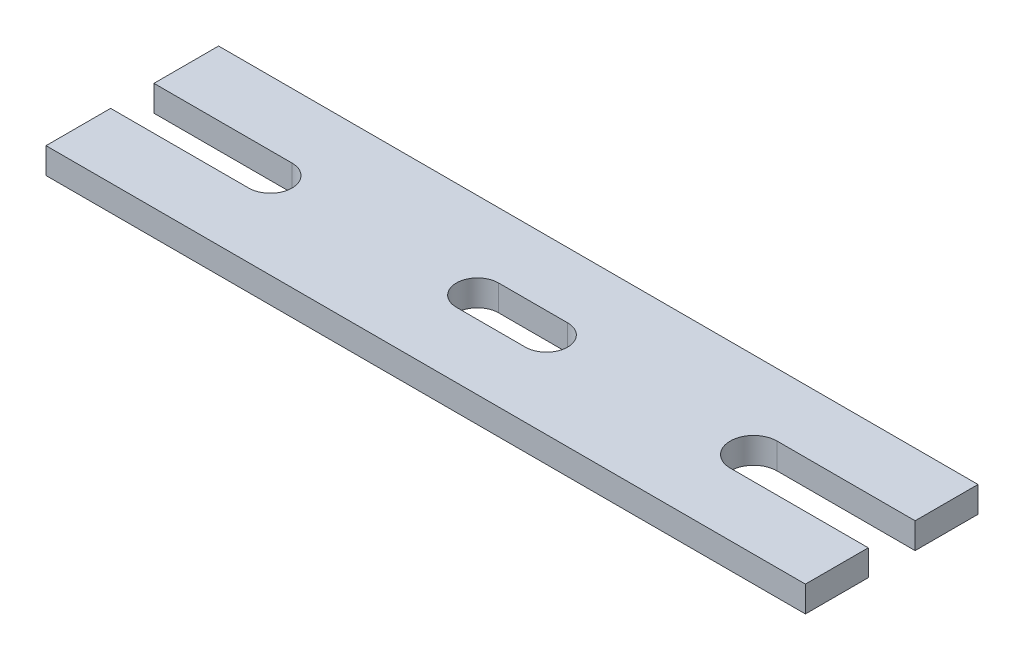
ISO-10303-21;
HEADER;
FILE_DESCRIPTION(('STEP AP214'),'2;1');
FILE_NAME('part.step','',(''),(''),'','','');
FILE_SCHEMA(('AUTOMOTIVE_DESIGN { 1 0 10303 214 1 1 1 1 }'));
ENDSEC;
DATA;
#1=APPLICATION_CONTEXT('core data for automotive mechanical design processes');
#2=APPLICATION_PROTOCOL_DEFINITION('international standard','automotive_design',2000,#1);
#3=PRODUCT_CONTEXT('',#1,'mechanical');
#4=PRODUCT('Part','Part','',(#3));
#5=PRODUCT_RELATED_PRODUCT_CATEGORY('part','',(#4));
#6=PRODUCT_DEFINITION_FORMATION('','',#4);
#7=PRODUCT_DEFINITION_CONTEXT('part definition',#1,'design');
#8=PRODUCT_DEFINITION('design','',#6,#7);
#9=PRODUCT_DEFINITION_SHAPE('','',#8);
#10=(LENGTH_UNIT() NAMED_UNIT(*) SI_UNIT(.MILLI.,.METRE.));
#11=(NAMED_UNIT(*) PLANE_ANGLE_UNIT() SI_UNIT($,.RADIAN.));
#12=(NAMED_UNIT(*) SI_UNIT($,.STERADIAN.) SOLID_ANGLE_UNIT());
#13=UNCERTAINTY_MEASURE_WITH_UNIT(LENGTH_MEASURE(1.E-05),#10,'distance_accuracy_value','');
#14=(GEOMETRIC_REPRESENTATION_CONTEXT(3) GLOBAL_UNCERTAINTY_ASSIGNED_CONTEXT((#13)) GLOBAL_UNIT_ASSIGNED_CONTEXT((#10,
#11,#12)) REPRESENTATION_CONTEXT('',''));
#15=CARTESIAN_POINT('',(0.,0.,0.));
#16=DIRECTION('',(0.,0.,1.));
#17=DIRECTION('',(1.,0.,0.));
#18=AXIS2_PLACEMENT_3D('',#15,#16,#17);
#19=CARTESIAN_POINT('',(139.7,9.525,-31.75));
#20=DIRECTION('',(-1.,0.,0.));
#21=DIRECTION('',(0.,0.,1.));
#22=AXIS2_PLACEMENT_3D('',#19,#20,#21);
#23=PLANE('',#22);
#24=DIRECTION('',(0.,0.,-1.));
#25=VECTOR('',#24,1.);
#26=CARTESIAN_POINT('',(139.7,9.525,-31.75));
#27=LINE('',#26,#25);
#28=CARTESIAN_POINT('',(139.7,9.525,-8.61859663606748));
#29=VERTEX_POINT('',#28);
#30=CARTESIAN_POINT('',(139.7,9.525,-31.75));
#31=VERTEX_POINT('',#30);
#32=EDGE_CURVE('E290',#29,#31,#27,.T.);
#33=ORIENTED_EDGE('',*,*,#32,.F.);
#34=DIRECTION('',(0.,1.,0.));
#35=VECTOR('',#34,1.);
#36=CARTESIAN_POINT('',(139.7,0.,-8.61859663606748));
#37=LINE('',#36,#35);
#38=CARTESIAN_POINT('',(139.7,0.,-8.61859663606748));
#39=VERTEX_POINT('',#38);
#40=EDGE_CURVE('E240',#39,#29,#37,.T.);
#41=ORIENTED_EDGE('',*,*,#40,.F.);
#42=DIRECTION('',(0.,0.,-1.));
#43=VECTOR('',#42,1.);
#44=CARTESIAN_POINT('',(139.7,0.,-31.75));
#45=LINE('',#44,#43);
#46=CARTESIAN_POINT('',(139.7,0.,-31.75));
#47=VERTEX_POINT('',#46);
#48=EDGE_CURVE('E275',#39,#47,#45,.T.);
#49=ORIENTED_EDGE('',*,*,#48,.T.);
#50=DIRECTION('',(0.,-1.,0.));
#51=VECTOR('',#50,1.);
#52=CARTESIAN_POINT('',(139.7,9.525,-31.75));
#53=LINE('',#52,#51);
#54=EDGE_CURVE('E11',#31,#47,#53,.T.);
#55=ORIENTED_EDGE('',*,*,#54,.F.);
#56=EDGE_LOOP('',(#33,#41,#49,#55));
#57=FACE_BOUND('',#56,.T.);
#58=ADVANCED_FACE('F49',(#57),#23,.F.);
#59=CARTESIAN_POINT('',(-139.7,9.525,-31.75));
#60=DIRECTION('',(1.,0.,0.));
#61=DIRECTION('',(0.,0.,-1.));
#62=AXIS2_PLACEMENT_3D('',#59,#60,#61);
#63=PLANE('',#62);
#64=DIRECTION('',(0.,0.,1.));
#65=VECTOR('',#64,1.);
#66=CARTESIAN_POINT('',(-139.7,9.525,-31.75));
#67=LINE('',#66,#65);
#68=CARTESIAN_POINT('',(-139.7,9.525,7.96996586486339));
#69=VERTEX_POINT('',#68);
#70=CARTESIAN_POINT('',(-139.7,9.525,31.75));
#71=VERTEX_POINT('',#70);
#72=EDGE_CURVE('E293',#69,#71,#67,.T.);
#73=ORIENTED_EDGE('',*,*,#72,.F.);
#74=DIRECTION('',(0.,1.,0.));
#75=VECTOR('',#74,1.);
#76=CARTESIAN_POINT('',(-139.7,0.,7.96996586486339));
#77=LINE('',#76,#75);
#78=CARTESIAN_POINT('',(-139.7,0.,7.96996586486339));
#79=VERTEX_POINT('',#78);
#80=EDGE_CURVE('E276',#79,#69,#77,.T.);
#81=ORIENTED_EDGE('',*,*,#80,.F.);
#82=DIRECTION('',(0.,0.,1.));
#83=VECTOR('',#82,1.);
#84=CARTESIAN_POINT('',(-139.7,0.,-31.75));
#85=LINE('',#84,#83);
#86=CARTESIAN_POINT('',(-139.7,0.,31.75));
#87=VERTEX_POINT('',#86);
#88=EDGE_CURVE('E309',#79,#87,#85,.T.);
#89=ORIENTED_EDGE('',*,*,#88,.T.);
#90=DIRECTION('',(0.,-1.,0.));
#91=VECTOR('',#90,1.);
#92=CARTESIAN_POINT('',(-139.7,9.525,31.75));
#93=LINE('',#92,#91);
#94=EDGE_CURVE('E320',#71,#87,#93,.T.);
#95=ORIENTED_EDGE('',*,*,#94,.F.);
#96=EDGE_LOOP('',(#73,#81,#89,#95));
#97=FACE_BOUND('',#96,.T.);
#98=ADVANCED_FACE('F401',(#97),#63,.F.);
#99=CARTESIAN_POINT('',(139.7,0.,31.75));
#100=VERTEX_POINT('',#99);
#101=CARTESIAN_POINT('',(139.7,0.,8.61859663606748));
#102=VERTEX_POINT('',#101);
#103=EDGE_CURVE('E302',#100,#102,#45,.T.);
#104=ORIENTED_EDGE('',*,*,#103,.T.);
#105=DIRECTION('',(0.,1.,0.));
#106=VECTOR('',#105,1.);
#107=CARTESIAN_POINT('',(139.7,0.,8.61859663606748));
#108=LINE('',#107,#106);
#109=CARTESIAN_POINT('',(139.7,9.525,8.61859663606748));
#110=VERTEX_POINT('',#109);
#111=EDGE_CURVE('E243',#102,#110,#108,.T.);
#112=ORIENTED_EDGE('',*,*,#111,.T.);
#113=CARTESIAN_POINT('',(139.7,9.525,31.75));
#114=VERTEX_POINT('',#113);
#115=EDGE_CURVE('E285',#114,#110,#27,.T.);
#116=ORIENTED_EDGE('',*,*,#115,.F.);
#117=DIRECTION('',(0.,-1.,0.));
#118=VECTOR('',#117,1.);
#119=CARTESIAN_POINT('',(139.7,9.525,31.75));
#120=LINE('',#119,#118);
#121=EDGE_CURVE('E301',#114,#100,#120,.T.);
#122=ORIENTED_EDGE('',*,*,#121,.T.);
#123=EDGE_LOOP('',(#104,#112,#116,#122));
#124=FACE_BOUND('',#123,.T.);
#125=ADVANCED_FACE('F51',(#124),#23,.F.);
#126=CARTESIAN_POINT('',(-139.7,9.525,-31.75));
#127=DIRECTION('',(0.,0.,1.));
#128=DIRECTION('',(1.,0.,0.));
#129=AXIS2_PLACEMENT_3D('',#126,#127,#128);
#130=PLANE('',#129);
#131=DIRECTION('',(-1.,0.,0.));
#132=VECTOR('',#131,1.);
#133=CARTESIAN_POINT('',(-139.7,0.,-31.75));
#134=LINE('',#133,#132);
#135=CARTESIAN_POINT('',(-139.7,0.,-31.75));
#136=VERTEX_POINT('',#135);
#137=EDGE_CURVE('E306',#47,#136,#134,.T.);
#138=ORIENTED_EDGE('',*,*,#137,.T.);
#139=DIRECTION('',(0.,-1.,0.));
#140=VECTOR('',#139,1.);
#141=CARTESIAN_POINT('',(-139.7,9.525,-31.75));
#142=LINE('',#141,#140);
#143=CARTESIAN_POINT('',(-139.7,9.525,-31.75));
#144=VERTEX_POINT('',#143);
#145=EDGE_CURVE('E58',#144,#136,#142,.T.);
#146=ORIENTED_EDGE('',*,*,#145,.F.);
#147=DIRECTION('',(-1.,0.,0.));
#148=VECTOR('',#147,1.);
#149=CARTESIAN_POINT('',(-139.7,9.525,-31.75));
#150=LINE('',#149,#148);
#151=EDGE_CURVE('E289',#31,#144,#150,.T.);
#152=ORIENTED_EDGE('',*,*,#151,.F.);
#153=ORIENTED_EDGE('',*,*,#54,.T.);
#154=EDGE_LOOP('',(#138,#146,#152,#153));
#155=FACE_BOUND('',#154,.T.);
#156=ADVANCED_FACE('F346',(#155),#130,.F.);
#157=CARTESIAN_POINT('',(-139.7,0.,-7.96996586486338));
#158=VERTEX_POINT('',#157);
#159=EDGE_CURVE('E310',#136,#158,#85,.T.);
#160=ORIENTED_EDGE('',*,*,#159,.T.);
#161=DIRECTION('',(0.,1.,0.));
#162=VECTOR('',#161,1.);
#163=CARTESIAN_POINT('',(-139.7,0.,-7.96996586486338));
#164=LINE('',#163,#162);
#165=CARTESIAN_POINT('',(-139.7,9.525,-7.96996586486338));
#166=VERTEX_POINT('',#165);
#167=EDGE_CURVE('E279',#158,#166,#164,.T.);
#168=ORIENTED_EDGE('',*,*,#167,.T.);
#169=EDGE_CURVE('E294',#144,#166,#67,.T.);
#170=ORIENTED_EDGE('',*,*,#169,.F.);
#171=ORIENTED_EDGE('',*,*,#145,.T.);
#172=EDGE_LOOP('',(#160,#168,#170,#171));
#173=FACE_BOUND('',#172,.T.);
#174=ADVANCED_FACE('F330',(#173),#63,.F.);
#175=CARTESIAN_POINT('',(-139.7,9.525,31.75));
#176=DIRECTION('',(0.,0.,-1.));
#177=DIRECTION('',(-1.,0.,0.));
#178=AXIS2_PLACEMENT_3D('',#175,#176,#177);
#179=PLANE('',#178);
#180=DIRECTION('',(1.,0.,0.));
#181=VECTOR('',#180,1.);
#182=CARTESIAN_POINT('',(-139.7,0.,31.75));
#183=LINE('',#182,#181);
#184=EDGE_CURVE('E314',#87,#100,#183,.T.);
#185=ORIENTED_EDGE('',*,*,#184,.T.);
#186=ORIENTED_EDGE('',*,*,#121,.F.);
#187=DIRECTION('',(1.,0.,0.));
#188=VECTOR('',#187,1.);
#189=CARTESIAN_POINT('',(-139.7,9.525,31.75));
#190=LINE('',#189,#188);
#191=EDGE_CURVE('E298',#71,#114,#190,.T.);
#192=ORIENTED_EDGE('',*,*,#191,.F.);
#193=ORIENTED_EDGE('',*,*,#94,.T.);
#194=EDGE_LOOP('',(#185,#186,#192,#193));
#195=FACE_BOUND('',#194,.T.);
#196=ADVANCED_FACE('F405',(#195),#179,.F.);
#197=CARTESIAN_POINT('',(0.,9.525,0.));
#198=DIRECTION('',(0.,1.,0.));
#199=DIRECTION('',(0.,0.,1.));
#200=AXIS2_PLACEMENT_3D('',#197,#198,#199);
#201=PLANE('',#200);
#202=CARTESIAN_POINT('',(12.7,9.525,0.));
#203=DIRECTION('',(0.,1.,0.));
#204=DIRECTION('',(0.,0.,1.));
#205=AXIS2_PLACEMENT_3D('',#202,#203,#204);
#206=CIRCLE('',#205,7.76111111111111);
#207=CARTESIAN_POINT('',(12.7,9.525,7.76111111111111));
#208=VERTEX_POINT('',#207);
#209=CARTESIAN_POINT('',(12.7,9.525,-7.76111111111111));
#210=VERTEX_POINT('',#209);
#211=EDGE_CURVE('E65',#208,#210,#206,.T.);
#212=ORIENTED_EDGE('',*,*,#211,.F.);
#213=DIRECTION('',(1.,0.,0.));
#214=VECTOR('',#213,1.);
#215=CARTESIAN_POINT('',(-12.7,9.525,7.76111111111111));
#216=LINE('',#215,#214);
#217=CARTESIAN_POINT('',(-12.7,9.525,7.76111111111111));
#218=VERTEX_POINT('',#217);
#219=EDGE_CURVE('E184',#218,#208,#216,.T.);
#220=ORIENTED_EDGE('',*,*,#219,.F.);
#221=CARTESIAN_POINT('',(-12.7,9.525,0.));
#222=DIRECTION('',(0.,1.,0.));
#223=DIRECTION('',(0.,0.,1.));
#224=AXIS2_PLACEMENT_3D('',#221,#222,#223);
#225=CIRCLE('',#224,7.76111111111111);
#226=CARTESIAN_POINT('',(-12.7,9.525,-7.76111111111111));
#227=VERTEX_POINT('',#226);
#228=EDGE_CURVE('E189',#227,#218,#225,.T.);
#229=ORIENTED_EDGE('',*,*,#228,.F.);
#230=DIRECTION('',(-1.,0.,0.));
#231=VECTOR('',#230,1.);
#232=CARTESIAN_POINT('',(-12.7,9.525,-7.76111111111111));
#233=LINE('',#232,#231);
#234=EDGE_CURVE('E198',#210,#227,#233,.T.);
#235=ORIENTED_EDGE('',*,*,#234,.F.);
#236=EDGE_LOOP('',(#212,#220,#229,#235));
#237=FACE_BOUND('',#236,.T.);
#238=DIRECTION('',(-1.,0.,0.));
#239=VECTOR('',#238,1.);
#240=CARTESIAN_POINT('',(139.7,9.525,-8.61859663606748));
#241=LINE('',#240,#239);
#242=CARTESIAN_POINT('',(88.9,9.525,-8.61859663606747));
#243=VERTEX_POINT('',#242);
#244=EDGE_CURVE('E218',#29,#243,#241,.T.);
#245=ORIENTED_EDGE('',*,*,#244,.F.);
#246=ORIENTED_EDGE('',*,*,#32,.T.);
#247=ORIENTED_EDGE('',*,*,#151,.T.);
#248=ORIENTED_EDGE('',*,*,#169,.T.);
#249=DIRECTION('',(-1.,0.,0.));
#250=VECTOR('',#249,1.);
#251=CARTESIAN_POINT('',(-139.7,9.525,-7.96996586486338));
#252=LINE('',#251,#250);
#253=CARTESIAN_POINT('',(-88.9,9.525,-7.96996586486338));
#254=VERTEX_POINT('',#253);
#255=EDGE_CURVE('E266',#254,#166,#252,.T.);
#256=ORIENTED_EDGE('',*,*,#255,.F.);
#257=CARTESIAN_POINT('',(-88.9,9.525,0.));
#258=DIRECTION('',(0.,1.,0.));
#259=DIRECTION('',(0.,0.,-1.));
#260=AXIS2_PLACEMENT_3D('',#257,#258,#259);
#261=CIRCLE('',#260,7.96996586486339);
#262=CARTESIAN_POINT('',(-88.9,9.525,7.96996586486339));
#263=VERTEX_POINT('',#262);
#264=EDGE_CURVE('E239',#263,#254,#261,.T.);
#265=ORIENTED_EDGE('',*,*,#264,.F.);
#266=DIRECTION('',(1.,0.,0.));
#267=VECTOR('',#266,1.);
#268=CARTESIAN_POINT('',(-139.7,9.525,7.96996586486339));
#269=LINE('',#268,#267);
#270=EDGE_CURVE('E254',#69,#263,#269,.T.);
#271=ORIENTED_EDGE('',*,*,#270,.F.);
#272=ORIENTED_EDGE('',*,*,#72,.T.);
#273=ORIENTED_EDGE('',*,*,#191,.T.);
#274=ORIENTED_EDGE('',*,*,#115,.T.);
#275=DIRECTION('',(1.,0.,0.));
#276=VECTOR('',#275,1.);
#277=CARTESIAN_POINT('',(139.7,9.525,8.61859663606748));
#278=LINE('',#277,#276);
#279=CARTESIAN_POINT('',(88.9,9.525,8.61859663606749));
#280=VERTEX_POINT('',#279);
#281=EDGE_CURVE('E230',#280,#110,#278,.T.);
#282=ORIENTED_EDGE('',*,*,#281,.F.);
#283=CARTESIAN_POINT('',(88.9,9.525,0.));
#284=DIRECTION('',(0.,1.,0.));
#285=DIRECTION('',(0.,0.,-1.));
#286=AXIS2_PLACEMENT_3D('',#283,#284,#285);
#287=CIRCLE('',#286,8.61859663606748);
#288=EDGE_CURVE('E207',#243,#280,#287,.T.);
#289=ORIENTED_EDGE('',*,*,#288,.F.);
#290=EDGE_LOOP('',(#245,#246,#247,#248,#256,#265,#271,#272,#273,#274,#282,#289));
#291=FACE_BOUND('',#290,.T.);
#292=ADVANCED_FACE('F342',(#237,#291),#201,.T.);
#293=CARTESIAN_POINT('',(0.,0.,0.));
#294=DIRECTION('',(0.,1.,0.));
#295=DIRECTION('',(0.,0.,1.));
#296=AXIS2_PLACEMENT_3D('',#293,#294,#295);
#297=PLANE('',#296);
#298=DIRECTION('',(1.,0.,0.));
#299=VECTOR('',#298,1.);
#300=CARTESIAN_POINT('',(-12.7,0.,7.76111111111111));
#301=LINE('',#300,#299);
#302=CARTESIAN_POINT('',(-12.7,0.,7.76111111111111));
#303=VERTEX_POINT('',#302);
#304=CARTESIAN_POINT('',(12.7,0.,7.76111111111111));
#305=VERTEX_POINT('',#304);
#306=EDGE_CURVE('E172',#303,#305,#301,.T.);
#307=ORIENTED_EDGE('',*,*,#306,.T.);
#308=CARTESIAN_POINT('',(12.7,0.,0.));
#309=DIRECTION('',(0.,1.,0.));
#310=DIRECTION('',(0.,0.,1.));
#311=AXIS2_PLACEMENT_3D('',#308,#309,#310);
#312=CIRCLE('',#311,7.76111111111111);
#313=CARTESIAN_POINT('',(12.7,0.,-7.76111111111111));
#314=VERTEX_POINT('',#313);
#315=EDGE_CURVE('E165',#305,#314,#312,.T.);
#316=ORIENTED_EDGE('',*,*,#315,.T.);
#317=DIRECTION('',(-1.,0.,0.));
#318=VECTOR('',#317,1.);
#319=CARTESIAN_POINT('',(-12.7,0.,-7.76111111111111));
#320=LINE('',#319,#318);
#321=CARTESIAN_POINT('',(-12.7,0.,-7.76111111111111));
#322=VERTEX_POINT('',#321);
#323=EDGE_CURVE('E175',#314,#322,#320,.T.);
#324=ORIENTED_EDGE('',*,*,#323,.T.);
#325=CARTESIAN_POINT('',(-12.7,0.,0.));
#326=DIRECTION('',(0.,1.,0.));
#327=DIRECTION('',(0.,0.,1.));
#328=AXIS2_PLACEMENT_3D('',#325,#326,#327);
#329=CIRCLE('',#328,7.76111111111111);
#330=EDGE_CURVE('E73',#322,#303,#329,.T.);
#331=ORIENTED_EDGE('',*,*,#330,.T.);
#332=EDGE_LOOP('',(#307,#316,#324,#331));
#333=FACE_BOUND('',#332,.T.);
#334=ORIENTED_EDGE('',*,*,#48,.F.);
#335=DIRECTION('',(-1.,0.,0.));
#336=VECTOR('',#335,1.);
#337=CARTESIAN_POINT('',(139.7,0.,-8.61859663606748));
#338=LINE('',#337,#336);
#339=CARTESIAN_POINT('',(88.9,0.,-8.61859663606747));
#340=VERTEX_POINT('',#339);
#341=EDGE_CURVE('E222',#39,#340,#338,.T.);
#342=ORIENTED_EDGE('',*,*,#341,.T.);
#343=CARTESIAN_POINT('',(88.9,0.,0.));
#344=DIRECTION('',(0.,1.,0.));
#345=DIRECTION('',(0.,0.,-1.));
#346=AXIS2_PLACEMENT_3D('',#343,#344,#345);
#347=CIRCLE('',#346,8.61859663606748);
#348=CARTESIAN_POINT('',(88.9,0.,8.61859663606749));
#349=VERTEX_POINT('',#348);
#350=EDGE_CURVE('E213',#340,#349,#347,.T.);
#351=ORIENTED_EDGE('',*,*,#350,.T.);
#352=DIRECTION('',(1.,0.,0.));
#353=VECTOR('',#352,1.);
#354=CARTESIAN_POINT('',(139.7,0.,8.61859663606748));
#355=LINE('',#354,#353);
#356=EDGE_CURVE('E217',#349,#102,#355,.T.);
#357=ORIENTED_EDGE('',*,*,#356,.T.);
#358=ORIENTED_EDGE('',*,*,#103,.F.);
#359=ORIENTED_EDGE('',*,*,#184,.F.);
#360=ORIENTED_EDGE('',*,*,#88,.F.);
#361=DIRECTION('',(1.,0.,0.));
#362=VECTOR('',#361,1.);
#363=CARTESIAN_POINT('',(-139.7,0.,7.96996586486339));
#364=LINE('',#363,#362);
#365=CARTESIAN_POINT('',(-88.9,0.,7.96996586486339));
#366=VERTEX_POINT('',#365);
#367=EDGE_CURVE('E258',#79,#366,#364,.T.);
#368=ORIENTED_EDGE('',*,*,#367,.T.);
#369=CARTESIAN_POINT('',(-88.9,0.,0.));
#370=DIRECTION('',(0.,1.,0.));
#371=DIRECTION('',(0.,0.,-1.));
#372=AXIS2_PLACEMENT_3D('',#369,#370,#371);
#373=CIRCLE('',#372,7.96996586486339);
#374=CARTESIAN_POINT('',(-88.9,0.,-7.96996586486338));
#375=VERTEX_POINT('',#374);
#376=EDGE_CURVE('E249',#366,#375,#373,.T.);
#377=ORIENTED_EDGE('',*,*,#376,.T.);
#378=DIRECTION('',(-1.,0.,0.));
#379=VECTOR('',#378,1.);
#380=CARTESIAN_POINT('',(-139.7,0.,-7.96996586486338));
#381=LINE('',#380,#379);
#382=EDGE_CURVE('E253',#375,#158,#381,.T.);
#383=ORIENTED_EDGE('',*,*,#382,.T.);
#384=ORIENTED_EDGE('',*,*,#159,.F.);
#385=ORIENTED_EDGE('',*,*,#137,.F.);
#386=EDGE_LOOP('',(#334,#342,#351,#357,#358,#359,#360,#368,#377,#383,#384,#385));
#387=FACE_BOUND('',#386,.T.);
#388=ADVANCED_FACE('F180',(#333,#387),#297,.F.);
#389=CARTESIAN_POINT('',(-88.9,0.,0.));
#390=DIRECTION('',(0.,1.,0.));
#391=DIRECTION('',(0.,0.,1.));
#392=AXIS2_PLACEMENT_3D('',#389,#390,#391);
#393=CYLINDRICAL_SURFACE('',#392,7.96996586486339);
#394=ORIENTED_EDGE('',*,*,#264,.T.);
#395=DIRECTION('',(0.,1.,0.));
#396=VECTOR('',#395,1.);
#397=CARTESIAN_POINT('',(-88.9,0.,-7.96996586486338));
#398=LINE('',#397,#396);
#399=EDGE_CURVE('E262',#375,#254,#398,.T.);
#400=ORIENTED_EDGE('',*,*,#399,.F.);
#401=ORIENTED_EDGE('',*,*,#376,.F.);
#402=DIRECTION('',(0.,1.,0.));
#403=VECTOR('',#402,1.);
#404=CARTESIAN_POINT('',(-88.9,0.,7.96996586486339));
#405=LINE('',#404,#403);
#406=EDGE_CURVE('E272',#366,#263,#405,.T.);
#407=ORIENTED_EDGE('',*,*,#406,.T.);
#408=EDGE_LOOP('',(#394,#400,#401,#407));
#409=FACE_BOUND('',#408,.T.);
#410=ADVANCED_FACE('F422',(#409),#393,.F.);
#411=CARTESIAN_POINT('',(-139.7,0.,7.96996586486339));
#412=DIRECTION('',(0.,0.,1.));
#413=DIRECTION('',(1.,0.,0.));
#414=AXIS2_PLACEMENT_3D('',#411,#412,#413);
#415=PLANE('',#414);
#416=ORIENTED_EDGE('',*,*,#270,.T.);
#417=ORIENTED_EDGE('',*,*,#406,.F.);
#418=ORIENTED_EDGE('',*,*,#367,.F.);
#419=ORIENTED_EDGE('',*,*,#80,.T.);
#420=EDGE_LOOP('',(#416,#417,#418,#419));
#421=FACE_BOUND('',#420,.T.);
#422=ADVANCED_FACE('F420',(#421),#415,.F.);
#423=CARTESIAN_POINT('',(-139.7,0.,-7.96996586486338));
#424=DIRECTION('',(0.,0.,-1.));
#425=DIRECTION('',(-1.,0.,0.));
#426=AXIS2_PLACEMENT_3D('',#423,#424,#425);
#427=PLANE('',#426);
#428=ORIENTED_EDGE('',*,*,#255,.T.);
#429=ORIENTED_EDGE('',*,*,#167,.F.);
#430=ORIENTED_EDGE('',*,*,#382,.F.);
#431=ORIENTED_EDGE('',*,*,#399,.T.);
#432=EDGE_LOOP('',(#428,#429,#430,#431));
#433=FACE_BOUND('',#432,.T.);
#434=ADVANCED_FACE('F338',(#433),#427,.F.);
#435=CARTESIAN_POINT('',(88.9,0.,0.));
#436=DIRECTION('',(0.,1.,0.));
#437=DIRECTION('',(0.,0.,1.));
#438=AXIS2_PLACEMENT_3D('',#435,#436,#437);
#439=CYLINDRICAL_SURFACE('',#438,8.61859663606748);
#440=ORIENTED_EDGE('',*,*,#288,.T.);
#441=DIRECTION('',(0.,1.,0.));
#442=VECTOR('',#441,1.);
#443=CARTESIAN_POINT('',(88.9,0.,8.61859663606749));
#444=LINE('',#443,#442);
#445=EDGE_CURVE('E226',#349,#280,#444,.T.);
#446=ORIENTED_EDGE('',*,*,#445,.F.);
#447=ORIENTED_EDGE('',*,*,#350,.F.);
#448=DIRECTION('',(0.,1.,0.));
#449=VECTOR('',#448,1.);
#450=CARTESIAN_POINT('',(88.9,0.,-8.61859663606747));
#451=LINE('',#450,#449);
#452=EDGE_CURVE('E236',#340,#243,#451,.T.);
#453=ORIENTED_EDGE('',*,*,#452,.T.);
#454=EDGE_LOOP('',(#440,#446,#447,#453));
#455=FACE_BOUND('',#454,.T.);
#456=ADVANCED_FACE('F416',(#455),#439,.F.);
#457=CARTESIAN_POINT('',(139.7,0.,-8.61859663606748));
#458=DIRECTION('',(0.,0.,-1.));
#459=DIRECTION('',(-1.,0.,0.));
#460=AXIS2_PLACEMENT_3D('',#457,#458,#459);
#461=PLANE('',#460);
#462=ORIENTED_EDGE('',*,*,#244,.T.);
#463=ORIENTED_EDGE('',*,*,#452,.F.);
#464=ORIENTED_EDGE('',*,*,#341,.F.);
#465=ORIENTED_EDGE('',*,*,#40,.T.);
#466=EDGE_LOOP('',(#462,#463,#464,#465));
#467=FACE_BOUND('',#466,.T.);
#468=ADVANCED_FACE('F418',(#467),#461,.F.);
#469=CARTESIAN_POINT('',(139.7,0.,8.61859663606748));
#470=DIRECTION('',(0.,0.,1.));
#471=DIRECTION('',(1.,0.,0.));
#472=AXIS2_PLACEMENT_3D('',#469,#470,#471);
#473=PLANE('',#472);
#474=ORIENTED_EDGE('',*,*,#281,.T.);
#475=ORIENTED_EDGE('',*,*,#111,.F.);
#476=ORIENTED_EDGE('',*,*,#356,.F.);
#477=ORIENTED_EDGE('',*,*,#445,.T.);
#478=EDGE_LOOP('',(#474,#475,#476,#477));
#479=FACE_BOUND('',#478,.T.);
#480=ADVANCED_FACE('F412',(#479),#473,.F.);
#481=CARTESIAN_POINT('',(12.7,0.,0.));
#482=DIRECTION('',(0.,1.,0.));
#483=DIRECTION('',(0.,0.,1.));
#484=AXIS2_PLACEMENT_3D('',#481,#482,#483);
#485=CYLINDRICAL_SURFACE('',#484,7.76111111111111);
#486=ORIENTED_EDGE('',*,*,#211,.T.);
#487=DIRECTION('',(0.,1.,0.));
#488=VECTOR('',#487,1.);
#489=CARTESIAN_POINT('',(12.7,0.,-7.76111111111111));
#490=LINE('',#489,#488);
#491=EDGE_CURVE('E161',#314,#210,#490,.T.);
#492=ORIENTED_EDGE('',*,*,#491,.F.);
#493=ORIENTED_EDGE('',*,*,#315,.F.);
#494=DIRECTION('',(0.,1.,0.));
#495=VECTOR('',#494,1.);
#496=CARTESIAN_POINT('',(12.7,0.,7.76111111111111));
#497=LINE('',#496,#495);
#498=EDGE_CURVE('E204',#305,#208,#497,.T.);
#499=ORIENTED_EDGE('',*,*,#498,.T.);
#500=EDGE_LOOP('',(#486,#492,#493,#499));
#501=FACE_BOUND('',#500,.T.);
#502=ADVANCED_FACE('F163',(#501),#485,.F.);
#503=CARTESIAN_POINT('',(-12.7,0.,7.76111111111111));
#504=DIRECTION('',(0.,0.,1.));
#505=DIRECTION('',(1.,0.,0.));
#506=AXIS2_PLACEMENT_3D('',#503,#504,#505);
#507=PLANE('',#506);
#508=ORIENTED_EDGE('',*,*,#219,.T.);
#509=ORIENTED_EDGE('',*,*,#498,.F.);
#510=ORIENTED_EDGE('',*,*,#306,.F.);
#511=DIRECTION('',(0.,1.,0.));
#512=VECTOR('',#511,1.);
#513=CARTESIAN_POINT('',(-12.7,0.,7.76111111111111));
#514=LINE('',#513,#512);
#515=EDGE_CURVE('E208',#303,#218,#514,.T.);
#516=ORIENTED_EDGE('',*,*,#515,.T.);
#517=EDGE_LOOP('',(#508,#509,#510,#516));
#518=FACE_BOUND('',#517,.T.);
#519=ADVANCED_FACE('F458',(#518),#507,.F.);
#520=CARTESIAN_POINT('',(-12.7,0.,0.));
#521=DIRECTION('',(0.,1.,0.));
#522=DIRECTION('',(0.,0.,1.));
#523=AXIS2_PLACEMENT_3D('',#520,#521,#522);
#524=CYLINDRICAL_SURFACE('',#523,7.76111111111111);
#525=ORIENTED_EDGE('',*,*,#228,.T.);
#526=ORIENTED_EDGE('',*,*,#515,.F.);
#527=ORIENTED_EDGE('',*,*,#330,.F.);
#528=DIRECTION('',(0.,1.,0.));
#529=VECTOR('',#528,1.);
#530=CARTESIAN_POINT('',(-12.7,0.,-7.76111111111111));
#531=LINE('',#530,#529);
#532=EDGE_CURVE('E171',#322,#227,#531,.T.);
#533=ORIENTED_EDGE('',*,*,#532,.T.);
#534=EDGE_LOOP('',(#525,#526,#527,#533));
#535=FACE_BOUND('',#534,.T.);
#536=ADVANCED_FACE('F456',(#535),#524,.F.);
#537=CARTESIAN_POINT('',(-12.7,0.,-7.76111111111111));
#538=DIRECTION('',(0.,0.,-1.));
#539=DIRECTION('',(-1.,0.,0.));
#540=AXIS2_PLACEMENT_3D('',#537,#538,#539);
#541=PLANE('',#540);
#542=ORIENTED_EDGE('',*,*,#234,.T.);
#543=ORIENTED_EDGE('',*,*,#532,.F.);
#544=ORIENTED_EDGE('',*,*,#323,.F.);
#545=ORIENTED_EDGE('',*,*,#491,.T.);
#546=EDGE_LOOP('',(#542,#543,#544,#545));
#547=FACE_BOUND('',#546,.T.);
#548=ADVANCED_FACE('F176',(#547),#541,.F.);
#549=CLOSED_SHELL('',(#58,#98,#125,#156,#174,#196,#292,#388,#410,#422,#434,#456,#468,#480,#502,
#519,#536,#548));
#550=MANIFOLD_SOLID_BREP('B2',#549);
#551=ADVANCED_BREP_SHAPE_REPRESENTATION('',(#18,#550),#14);
#552=SHAPE_DEFINITION_REPRESENTATION(#9,#551);
ENDSEC;
END-ISO-10303-21;
